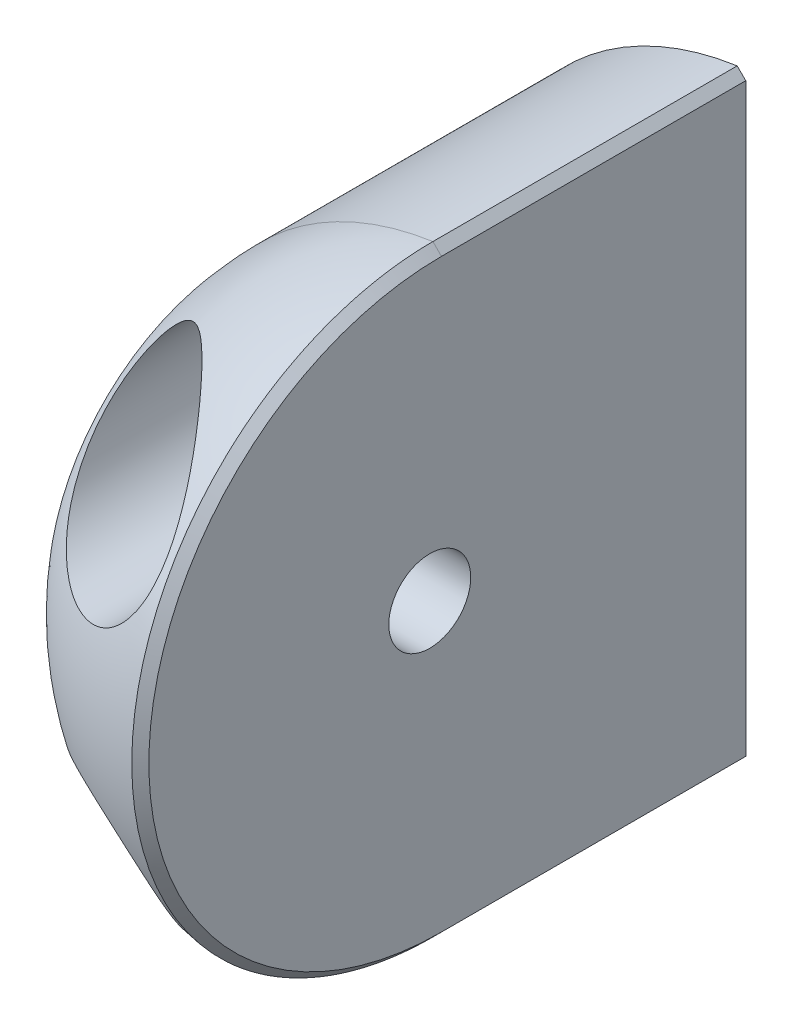
ISO-10303-21;
HEADER;
FILE_DESCRIPTION(('STEP AP214'),'2;1');
FILE_NAME('part.step','',(''),(''),'','','');
FILE_SCHEMA(('AUTOMOTIVE_DESIGN { 1 0 10303 214 1 1 1 1 }'));
ENDSEC;
DATA;
#1=APPLICATION_CONTEXT('core data for automotive mechanical design processes');
#2=APPLICATION_PROTOCOL_DEFINITION('international standard','automotive_design',2000,#1);
#3=PRODUCT_CONTEXT('',#1,'mechanical');
#4=PRODUCT('Part','Part','',(#3));
#5=PRODUCT_RELATED_PRODUCT_CATEGORY('part','',(#4));
#6=PRODUCT_DEFINITION_FORMATION('','',#4);
#7=PRODUCT_DEFINITION_CONTEXT('part definition',#1,'design');
#8=PRODUCT_DEFINITION('design','',#6,#7);
#9=PRODUCT_DEFINITION_SHAPE('','',#8);
#10=(LENGTH_UNIT() NAMED_UNIT(*) SI_UNIT(.MILLI.,.METRE.));
#11=(NAMED_UNIT(*) PLANE_ANGLE_UNIT() SI_UNIT($,.RADIAN.));
#12=(NAMED_UNIT(*) SI_UNIT($,.STERADIAN.) SOLID_ANGLE_UNIT());
#13=UNCERTAINTY_MEASURE_WITH_UNIT(LENGTH_MEASURE(1.E-05),#10,'distance_accuracy_value','');
#14=(GEOMETRIC_REPRESENTATION_CONTEXT(3) GLOBAL_UNCERTAINTY_ASSIGNED_CONTEXT((#13)) GLOBAL_UNIT_ASSIGNED_CONTEXT((#10,
#11,#12)) REPRESENTATION_CONTEXT('',''));
#15=CARTESIAN_POINT('',(0.,0.,0.));
#16=DIRECTION('',(0.,0.,1.));
#17=DIRECTION('',(1.,0.,0.));
#18=AXIS2_PLACEMENT_3D('',#15,#16,#17);
#19=CARTESIAN_POINT('',(-23.5,55.5,-13.));
#20=DIRECTION('',(0.,0.,1.));
#21=DIRECTION('',(1.,0.,0.));
#22=AXIS2_PLACEMENT_3D('',#19,#20,#21);
#23=CYLINDRICAL_SURFACE('',#22,13.);
#24=CARTESIAN_POINT('',(-23.5,55.5,-13.));
#25=DIRECTION('',(0.,0.,-1.));
#26=DIRECTION('',(-1.,0.,0.));
#27=AXIS2_PLACEMENT_3D('',#24,#25,#26);
#28=CIRCLE('',#27,13.);
#29=CARTESIAN_POINT('',(-33.5,63.8066238629181,-13.));
#30=VERTEX_POINT('',#29);
#31=CARTESIAN_POINT('',(-25.3654599313282,68.3654599313281,-13.));
#32=VERTEX_POINT('',#31);
#33=EDGE_CURVE('E230',#30,#32,#28,.T.);
#34=ORIENTED_EDGE('',*,*,#33,.F.);
#35=DIRECTION('',(0.,0.,-1.));
#36=VECTOR('',#35,1.);
#37=CARTESIAN_POINT('',(-33.5,63.8066238629181,12.8654599313281));
#38=LINE('',#37,#36);
#39=CARTESIAN_POINT('',(-33.5,63.8066238629181,0.));
#40=VERTEX_POINT('',#39);
#41=EDGE_CURVE('E138',#40,#30,#38,.T.);
#42=ORIENTED_EDGE('',*,*,#41,.F.);
#43=CARTESIAN_POINT('',(-23.5,55.5,0.));
#44=DIRECTION('',(0.,0.,1.));
#45=DIRECTION('',(1.,0.,0.));
#46=AXIS2_PLACEMENT_3D('',#43,#44,#45);
#47=CIRCLE('',#46,13.);
#48=CARTESIAN_POINT('',(-25.3654599313281,68.3654599313281,0.));
#49=VERTEX_POINT('',#48);
#50=EDGE_CURVE('E188',#49,#40,#47,.T.);
#51=ORIENTED_EDGE('',*,*,#50,.F.);
#52=DIRECTION('',(0.,0.,1.));
#53=VECTOR('',#52,1.);
#54=CARTESIAN_POINT('',(-25.3654599313281,68.3654599313281,-13.));
#55=LINE('',#54,#53);
#56=EDGE_CURVE('E117',#49,#32,#55,.F.);
#57=ORIENTED_EDGE('',*,*,#56,.T.);
#58=EDGE_LOOP('',(#34,#42,#51,#57));
#59=FACE_BOUND('',#58,.T.);
#60=ADVANCED_FACE('F32',(#59),#23,.T.);
#61=CARTESIAN_POINT('',(-29.1999999999999,49.,13.));
#62=DIRECTION('',(0.,0.,-1.));
#63=DIRECTION('',(-1.,0.,0.));
#64=AXIS2_PLACEMENT_3D('',#61,#62,#63);
#65=CYLINDRICAL_SURFACE('',#64,2.5);
#66=CARTESIAN_POINT('',(-29.1999999999999,49.,-13.));
#67=DIRECTION('',(0.,0.,-1.));
#68=DIRECTION('',(-1.,0.,0.));
#69=AXIS2_PLACEMENT_3D('',#66,#67,#68);
#70=CIRCLE('',#69,2.5);
#71=CARTESIAN_POINT('',(-31.6999999999999,49.,-13.));
#72=VERTEX_POINT('',#71);
#73=EDGE_CURVE('E221',#72,#72,#70,.T.);
#74=ORIENTED_EDGE('',*,*,#73,.T.);
#75=EDGE_LOOP('',(#74));
#76=FACE_BOUND('',#75,.T.);
#77=CARTESIAN_POINT('',(-29.1999999999999,49.,-6.5));
#78=DIRECTION('',(0.,0.,1.));
#79=DIRECTION('',(1.,0.,0.));
#80=AXIS2_PLACEMENT_3D('',#77,#78,#79);
#81=CIRCLE('',#80,2.5);
#82=CARTESIAN_POINT('',(-26.6999999999999,49.,-6.5));
#83=VERTEX_POINT('',#82);
#84=EDGE_CURVE('E204',#83,#83,#81,.T.);
#85=ORIENTED_EDGE('',*,*,#84,.T.);
#86=EDGE_LOOP('',(#85));
#87=FACE_BOUND('',#86,.T.);
#88=ADVANCED_FACE('F270',(#76,#87),#65,.F.);
#89=CARTESIAN_POINT('',(-29.1999999999998,62.,13.));
#90=DIRECTION('',(0.,0.,-1.));
#91=DIRECTION('',(-1.,0.,0.));
#92=AXIS2_PLACEMENT_3D('',#89,#90,#91);
#93=CYLINDRICAL_SURFACE('',#92,2.5);
#94=CARTESIAN_POINT('',(-29.1999999999998,62.,-13.));
#95=DIRECTION('',(0.,0.,-1.));
#96=DIRECTION('',(-1.,0.,0.));
#97=AXIS2_PLACEMENT_3D('',#94,#95,#96);
#98=CIRCLE('',#97,2.5);
#99=CARTESIAN_POINT('',(-31.6999999999998,62.,-13.));
#100=VERTEX_POINT('',#99);
#101=EDGE_CURVE('E231',#100,#100,#98,.T.);
#102=ORIENTED_EDGE('',*,*,#101,.T.);
#103=EDGE_LOOP('',(#102));
#104=FACE_BOUND('',#103,.T.);
#105=CARTESIAN_POINT('',(-29.1999999999998,62.,-6.5));
#106=DIRECTION('',(0.,0.,1.));
#107=DIRECTION('',(1.,0.,0.));
#108=AXIS2_PLACEMENT_3D('',#105,#106,#107);
#109=CIRCLE('',#108,2.5);
#110=CARTESIAN_POINT('',(-26.6999999999998,62.,-6.5));
#111=VERTEX_POINT('',#110);
#112=EDGE_CURVE('E222',#111,#111,#109,.T.);
#113=ORIENTED_EDGE('',*,*,#112,.T.);
#114=EDGE_LOOP('',(#113));
#115=FACE_BOUND('',#114,.T.);
#116=ADVANCED_FACE('F211',(#104,#115),#93,.F.);
#117=CARTESIAN_POINT('',(-23.5,55.5,0.));
#118=DIRECTION('',(0.,-1.,0.));
#119=DIRECTION('',(0.,0.,1.));
#120=AXIS2_PLACEMENT_3D('',#117,#118,#119);
#121=SPHERICAL_SURFACE('',#120,13.);
#122=CARTESIAN_POINT('',(-30.7731713308915,45.8734792558403,4.84056578859972));
#123=CARTESIAN_POINT('',(-30.8619727950089,45.9181646135803,4.7960052292137));
#124=CARTESIAN_POINT('',(-30.951140970031,45.967771100755,4.75699494009806));
#125=CARTESIAN_POINT('',(-31.1284422234021,46.0773428698477,4.69384980519464));
#126=CARTESIAN_POINT('',(-31.2165764645147,46.1372950195693,4.66969627636443));
#127=CARTESIAN_POINT('',(-31.3897336302836,46.2674430844061,4.63940255595307));
#128=CARTESIAN_POINT('',(-31.474720364549,46.3377283735637,4.63343054697689));
#129=CARTESIAN_POINT('',(-31.6371503752147,46.4855666764086,4.64099765258224));
#130=CARTESIAN_POINT('',(-31.7145917184646,46.5631215426486,4.65454175328599));
#131=CARTESIAN_POINT('',(-31.8637567587637,46.7268094937979,4.70023561908632));
#132=CARTESIAN_POINT('',(-31.9348917690989,46.813179314776,4.73341494763122));
#133=CARTESIAN_POINT('',(-32.0656690142341,46.9875684760903,4.81470825559536));
#134=CARTESIAN_POINT('',(-32.1252869329177,47.0755908850642,4.86285328529589));
#135=CARTESIAN_POINT('',(-32.2658553828278,47.3036371124902,5.00136458460291));
#136=CARTESIAN_POINT('',(-32.3386136859353,47.4436742029609,5.09987451090306));
#137=CARTESIAN_POINT('',(-32.4618241954573,47.7218249127127,5.31228155613165));
#138=CARTESIAN_POINT('',(-32.5122103697854,47.85993168791,5.42622294680135));
#139=CARTESIAN_POINT('',(-32.589244018333,48.1174921560098,5.64897675372043));
#140=CARTESIAN_POINT('',(-32.6180051636216,48.2372070635038,5.75678170983932));
#141=CARTESIAN_POINT('',(-32.6625075498483,48.4749479105977,5.97694487104717));
#142=CARTESIAN_POINT('',(-32.6782396208657,48.592972603303,6.0893062247066));
#143=CARTESIAN_POINT('',(-32.6977116549664,48.8272828060769,6.31694024911347));
#144=CARTESIAN_POINT('',(-32.7014447599822,48.9435672837418,6.43221454685019));
#145=CARTESIAN_POINT('',(-32.697565416748,49.1741465548889,6.66446929960028));
#146=CARTESIAN_POINT('',(-32.6899555631501,49.2884417973503,6.78144935836771));
#147=CARTESIAN_POINT('',(-32.6630198849927,49.5216065962778,7.02338552694212));
#148=CARTESIAN_POINT('',(-32.6430187955437,49.6403394006928,7.14839923865985));
#149=CARTESIAN_POINT('',(-32.591028129609,49.8748512254301,7.39872028470763));
#150=CARTESIAN_POINT('',(-32.5590340092676,49.9906291084271,7.52402771241491));
#151=CARTESIAN_POINT('',(-32.4452298855063,50.3327567101925,7.89953255854781));
#152=CARTESIAN_POINT('',(-32.3455891584671,50.5539769403998,8.1493920967124));
#153=CARTESIAN_POINT('',(-32.1501192775465,50.8887599413491,8.54129690779853));
#154=CARTESIAN_POINT('',(-32.0696027693782,51.0091557383828,8.68538756323934));
#155=CARTESIAN_POINT('',(-31.892266367979,51.2412103277749,8.97074172281868));
#156=CARTESIAN_POINT('',(-31.7954419257805,51.3528666695684,9.11200442578721));
#157=CARTESIAN_POINT('',(-31.5857551755015,51.5652300648439,9.39040680083171));
#158=CARTESIAN_POINT('',(-31.4729169412152,51.6659531604353,9.5275522940828));
#159=CARTESIAN_POINT('',(-31.2314240749443,51.8542504976179,9.79668947473079));
#160=CARTESIAN_POINT('',(-31.1027799692453,51.9418334048097,9.92868451583073));
#161=CARTESIAN_POINT('',(-30.7939908398866,52.122351285729,10.2203493215423));
#162=CARTESIAN_POINT('',(-30.6092190430445,52.2105863485905,10.3781167675911));
#163=CARTESIAN_POINT('',(-30.2173089730363,52.3553836527353,10.6796699485498));
#164=CARTESIAN_POINT('',(-30.0102043537847,52.4119927777642,10.8234761173959));
#165=CARTESIAN_POINT('',(-29.6180118224716,52.4795345214665,11.0675492257298));
#166=CARTESIAN_POINT('',(-29.4360079556056,52.4970108467327,11.1709367742243));
#167=CARTESIAN_POINT('',(-29.0636108294,52.5022802803081,11.3623776977585));
#168=CARTESIAN_POINT('',(-28.8732258519588,52.4901020731181,11.4504458028238));
#169=CARTESIAN_POINT('',(-28.5191525253904,52.4370607095547,11.5955981958156));
#170=CARTESIAN_POINT('',(-28.3558660123791,52.4009017679717,11.6553651198937));
#171=CARTESIAN_POINT('',(-28.0316814424963,52.3035769434372,11.7591680707859));
#172=CARTESIAN_POINT('',(-27.8707824594256,52.2424210351491,11.8032103591612));
#173=CARTESIAN_POINT('',(-27.5558759647742,52.0947108436188,11.8737323692016));
#174=CARTESIAN_POINT('',(-27.4019061868323,52.0080332773524,11.9001247596204));
#175=CARTESIAN_POINT('',(-27.1074777043253,51.8111682419632,11.9335758924912));
#176=CARTESIAN_POINT('',(-26.9670140007342,51.7009895203364,11.9406418150656));
#177=CARTESIAN_POINT('',(-26.7163763055407,51.4714211922255,11.9353164329985));
#178=CARTESIAN_POINT('',(-26.6046223222058,51.3537070535954,11.9245900744791));
#179=CARTESIAN_POINT('',(-26.3995127842316,51.1055128390508,11.8872858865309));
#180=CARTESIAN_POINT('',(-26.3061558358896,50.9750337312925,11.8607092584843));
#181=CARTESIAN_POINT('',(-26.1394153474627,50.7052892911294,11.7928185032831));
#182=CARTESIAN_POINT('',(-26.0660563965128,50.5660133991042,11.7514863759255));
#183=CARTESIAN_POINT('',(-25.9398760520319,50.2828284991487,11.6556627364691));
#184=CARTESIAN_POINT('',(-25.8870598147843,50.1389183378049,11.6011679260537));
#185=CARTESIAN_POINT('',(-25.7971447503708,49.8354978122602,11.4746850260017));
#186=CARTESIAN_POINT('',(-25.7621536082963,49.6758704428133,11.4014906099005));
#187=CARTESIAN_POINT('',(-25.7147789091377,49.3590868991332,11.243482993892));
#188=CARTESIAN_POINT('',(-25.702410049171,49.2019323971299,11.1586622791078));
#189=CARTESIAN_POINT('',(-25.6973313157656,48.8262487134251,10.9406601477402));
#190=CARTESIAN_POINT('',(-25.7154038213249,48.6104888411348,10.8024012160466));
#191=CARTESIAN_POINT('',(-25.7871689847277,48.1955686510909,10.510947540325));
#192=CARTESIAN_POINT('',(-25.8409306206111,47.9964413205314,10.3577243642756));
#193=CARTESIAN_POINT('',(-25.9968317968406,47.5663316810109,9.99646344972966));
#194=CARTESIAN_POINT('',(-26.1082068299647,47.3416370875196,9.78493497416006));
#195=CARTESIAN_POINT('',(-26.368027581708,46.9288855564158,9.34973106056768));
#196=CARTESIAN_POINT('',(-26.5164906522024,46.7408458415409,9.1260499753081));
#197=CARTESIAN_POINT('',(-26.8444134557199,46.4003965056931,8.66731115729006));
#198=CARTESIAN_POINT('',(-27.0243226454668,46.2485916869892,8.43213004497077));
#199=CARTESIAN_POINT('',(-27.4067795486744,45.9853134211941,7.95726904985924));
#200=CARTESIAN_POINT('',(-27.6093470659088,45.8738756218161,7.71758538639488));
#201=CARTESIAN_POINT('',(-27.946589658659,45.7292573743275,7.33483347816924));
#202=CARTESIAN_POINT('',(-28.0757062361781,45.6826401876914,7.19177662408995));
#203=CARTESIAN_POINT('',(-28.3395401901459,45.6046291266595,6.90649928555428));
#204=CARTESIAN_POINT('',(-28.4742598322595,45.5732414767792,6.76427916650302));
#205=CARTESIAN_POINT('',(-28.7487744120972,45.5264142118883,6.48207380851203));
#206=CARTESIAN_POINT('',(-28.8885702864824,45.510977555777,6.34208898895882));
#207=CARTESIAN_POINT('',(-29.1730035456136,45.4972081086282,6.0663333126501));
#208=CARTESIAN_POINT('',(-29.3176368107602,45.4988611157236,5.93055905094252));
#209=CARTESIAN_POINT('',(-29.5431668519085,45.5159797346806,5.72805553279235));
#210=CARTESIAN_POINT('',(-29.6222637746574,45.5246296533504,5.65871083990498));
#211=CARTESIAN_POINT('',(-29.7819612209265,45.5477782572214,5.52280407486055));
#212=CARTESIAN_POINT('',(-29.8625612329522,45.5622749862082,5.45624108022077));
#213=CARTESIAN_POINT('',(-30.0249506469735,45.5976001176304,5.32714808877782));
#214=CARTESIAN_POINT('',(-30.1067321246341,45.6183966214597,5.26459965461076));
#215=CARTESIAN_POINT('',(-30.2718343376384,45.6670464491189,5.14454077630667));
#216=CARTESIAN_POINT('',(-30.3551543640207,45.6948965943333,5.08702807856025));
#217=CARTESIAN_POINT('',(-30.5494711766201,45.7684659982163,4.96196339783756));
#218=CARTESIAN_POINT('',(-30.6610288425895,45.8170485735602,4.89683886989785));
#219=CARTESIAN_POINT('',(-30.7731713308915,45.8734792558403,4.84056578859972));
#220=B_SPLINE_CURVE_WITH_KNOTS('',3,(#122,#123,#124,#125,#126,#127,#128,#129,#130,#131,#132,
#133,#134,#135,#136,#137,#138,#139,#140,#141,#142,#143,#144,#145,#146,#147,#148,#149,#150,#151,
#152,#153,#154,#155,#156,#157,#158,#159,#160,#161,#162,#163,#164,#165,#166,#167,#168,#169,#170,
#171,#172,#173,#174,#175,#176,#177,#178,#179,#180,#181,#182,#183,#184,#185,#186,#187,#188,#189,
#190,#191,#192,#193,#194,#195,#196,#197,#198,#199,#200,#201,#202,#203,#204,#205,#206,#207,#208,
#209,#210,#211,#212,#213,#214,#215,#216,#217,#218,#219),.UNSPECIFIED.,.T.,.F.,(4,2,2,2,2,2,2,2,
2,2,2,2,2,2,2,2,2,2,2,2,2,2,2,2,2,2,2,2,2,2,2,2,2,2,2,2,2,2,2,2,2,2,2,2,2,2,2,2,4),(0.,
0.326516817541047,0.65262218154321,0.981735056429128,1.31093203045322,1.65914508961175,
2.00808548554219,2.56308193164554,3.11970575269486,3.60998300326751,4.10060502062323,
4.59150740557064,5.08229751597845,5.60252149935342,6.12294278196345,7.16345582478041,
7.77568173544741,8.38807870531564,8.99956461354836,9.61064547377463,10.3831813071832,
11.1545688381974,11.782279959157,12.4093841433355,12.9399546092666,13.4703135654064,
14.0032776823945,14.5360437669398,15.0217091070194,15.5073376404347,15.9935606268825,
16.4799055781387,17.0150289458206,17.5504998461299,18.3169653658917,19.0849165990154,
20.0639439331979,21.0434301722335,22.038272172744,23.033990578821,23.6282219660163,
24.222696019383,24.8172803275244,25.4113705634296,25.7278386797959,26.0442010005995,
26.3589874780997,26.6736323535044,27.0859724962642),.UNSPECIFIED.);
#221=CARTESIAN_POINT('',(-30.7731713308915,45.8734792558403,4.84056578859972));
#222=VERTEX_POINT('',#221);
#223=EDGE_CURVE('E197',#222,#222,#220,.T.);
#224=ORIENTED_EDGE('',*,*,#223,.T.);
#225=EDGE_LOOP('',(#224));
#226=FACE_BOUND('',#225,.T.);
#227=CARTESIAN_POINT('',(-32.6928072018036,62.2242718239711,6.26709375929672));
#228=CARTESIAN_POINT('',(-32.6859911263324,62.3304306461002,6.16318910613144));
#229=CARTESIAN_POINT('',(-32.6742773837024,62.4373411130493,6.06036733012357));
#230=CARTESIAN_POINT('',(-32.6403298496844,62.652707887824,5.85792453817322));
#231=CARTESIAN_POINT('',(-32.6180884956682,62.7611652524726,5.75830587825242));
#232=CARTESIAN_POINT('',(-32.5621174186281,62.9791817973295,5.56433877786192));
#233=CARTESIAN_POINT('',(-32.5284275931308,63.08873588569,5.46997334166268));
#234=CARTESIAN_POINT('',(-32.4480491829262,63.3091701218667,5.28877999783641));
#235=CARTESIAN_POINT('',(-32.4013811201123,63.420047913804,5.20194047187255));
#236=CARTESIAN_POINT('',(-32.304216795494,63.6197068435638,5.05666664373923));
#237=CARTESIAN_POINT('',(-32.2565458001152,63.7082767664269,4.99608439960857));
#238=CARTESIAN_POINT('',(-32.1504627200332,63.8855858702534,4.885199790791));
#239=CARTESIAN_POINT('',(-32.092052573812,63.9743250178144,4.83489557431198));
#240=CARTESIAN_POINT('',(-31.9625820929905,64.1518243192317,4.74813357341066));
#241=CARTESIAN_POINT('',(-31.8913563712829,64.2405674339955,4.71187912876));
#242=CARTESIAN_POINT('',(-31.737244034895,64.4136498262124,4.65926070129644));
#243=CARTESIAN_POINT('',(-31.6543888376576,64.4980001558291,4.6428442373497));
#244=CARTESIAN_POINT('',(-31.4900898624298,64.6488545538007,4.63334390033171));
#245=CARTESIAN_POINT('',(-31.4096436221108,64.7162887802697,4.6377242344742));
#246=CARTESIAN_POINT('',(-31.2447348816441,64.8425117746501,4.66342384819831));
#247=CARTESIAN_POINT('',(-31.1602675729016,64.9012898290033,4.68476391306436));
#248=CARTESIAN_POINT('',(-30.9717032480745,65.020946094156,4.74778395936651));
#249=CARTESIAN_POINT('',(-30.8673167247024,65.079522342542,4.79286802985258));
#250=CARTESIAN_POINT('',(-30.659507683218,65.1833020562611,4.89810555720448));
#251=CARTESIAN_POINT('',(-30.5560879352348,65.2284744475975,4.9582934424929));
#252=CARTESIAN_POINT('',(-30.3678979356648,65.3006762924565,5.07840454573323));
#253=CARTESIAN_POINT('',(-30.2828018190063,65.3294548482217,5.13681552085874));
#254=CARTESIAN_POINT('',(-30.1142067128721,65.3796402424588,5.25894001367314));
#255=CARTESIAN_POINT('',(-30.0307088657149,65.4010419816676,5.32265716165637));
#256=CARTESIAN_POINT('',(-29.8651961033537,65.4372522753523,5.45406386324116));
#257=CARTESIAN_POINT('',(-29.7831843513002,65.45204806199,5.52176082574172));
#258=CARTESIAN_POINT('',(-29.6207160943439,65.4755910666163,5.66003028788985));
#259=CARTESIAN_POINT('',(-29.5402601122373,65.484336284581,5.73060373020689));
#260=CARTESIAN_POINT('',(-29.326039968562,65.500332760178,5.92312334805262));
#261=CARTESIAN_POINT('',(-29.1936442657372,65.5024258419451,6.04703941774622));
#262=CARTESIAN_POINT('',(-28.9329119457659,65.4922312962489,6.29854411795461));
#263=CARTESIAN_POINT('',(-28.8045778756666,65.4799348216977,6.4261349607548));
#264=CARTESIAN_POINT('',(-28.5520330875806,65.4418669173877,6.68349603424949));
#265=CARTESIAN_POINT('',(-28.4278246871751,65.4160880456668,6.81326743022949));
#266=CARTESIAN_POINT('',(-28.1839464636907,65.3516469953035,7.07379513505867));
#267=CARTESIAN_POINT('',(-28.064275693692,65.3129875212693,7.20455123151632));
#268=CARTESIAN_POINT('',(-27.8256194853099,65.221489846786,7.47107483130704));
#269=CARTESIAN_POINT('',(-27.7068210974239,65.16818250127,7.60684979226669));
#270=CARTESIAN_POINT('',(-27.4753963046875,65.0483981630782,7.87779892747469));
#271=CARTESIAN_POINT('',(-27.3627705888357,64.9819197040387,8.01297303311396));
#272=CARTESIAN_POINT('',(-27.0357010995391,64.7630677517368,8.41635613043842));
#273=CARTESIAN_POINT('',(-26.8316593722938,64.5911232898298,8.68287701785993));
#274=CARTESIAN_POINT('',(-26.4885442070189,64.2252195480377,9.16749471059408));
#275=CARTESIAN_POINT('',(-26.3443495530753,64.0379595018998,9.38705234919822));
#276=CARTESIAN_POINT('',(-26.0924401509716,63.628117861692,9.81407219351423));
#277=CARTESIAN_POINT('',(-25.9846881986328,63.4055726331985,10.0215465547118));
#278=CARTESIAN_POINT('',(-25.8345431933781,62.9811692712333,10.3752193815855));
#279=CARTESIAN_POINT('',(-25.7830062075867,62.7854466593961,10.5248894788211));
#280=CARTESIAN_POINT('',(-25.7143699679927,62.3780758176466,10.8097827473915));
#281=CARTESIAN_POINT('',(-25.6972253337783,62.1664489565229,10.9450247329644));
#282=CARTESIAN_POINT('',(-25.7029009597076,61.7741843636872,11.1724167890035));
#283=CARTESIAN_POINT('',(-25.718682674265,61.5953940753516,11.2678556592943));
#284=CARTESIAN_POINT('',(-25.7644139808778,61.3253816289246,11.3994585069656));
#285=CARTESIAN_POINT('',(-25.7833484579223,61.2350295967175,11.4414174055942));
#286=CARTESIAN_POINT('',(-25.8288729660853,61.0543968115337,11.5210795170537));
#287=CARTESIAN_POINT('',(-25.855459519863,60.9641160448163,11.5587846521173));
#288=CARTESIAN_POINT('',(-25.916793095178,60.7835595155678,11.6298564452146));
#289=CARTESIAN_POINT('',(-25.951612807153,60.6932914110221,11.6631800868181));
#290=CARTESIAN_POINT('',(-26.0293665104779,60.514545720331,11.7246352482446));
#291=CARTESIAN_POINT('',(-26.0722961269606,60.4260671971585,11.7527695513451));
#292=CARTESIAN_POINT('',(-26.1662130901779,60.2518805251146,11.8034472304173));
#293=CARTESIAN_POINT('',(-26.2171960532395,60.1661708994474,11.8259936309946));
#294=CARTESIAN_POINT('',(-26.3270101815971,59.9985091162575,11.8651527625872));
#295=CARTESIAN_POINT('',(-26.3858398266924,59.9165562350326,11.8817666406708));
#296=CARTESIAN_POINT('',(-26.5017998300862,59.7690377142429,11.9068099741929));
#297=CARTESIAN_POINT('',(-26.557928466855,59.7028244045316,11.9160793083574));
#298=CARTESIAN_POINT('',(-26.6752202826253,59.5745017600968,11.9299628839458));
#299=CARTESIAN_POINT('',(-26.7363828860979,59.5123919576827,11.9345776567239));
#300=CARTESIAN_POINT('',(-26.8632480828979,59.3928600435299,11.9390869525187));
#301=CARTESIAN_POINT('',(-26.9289487027501,59.3354359175077,11.9389835146285));
#302=CARTESIAN_POINT('',(-27.0643249021,59.2257441298392,11.9340699260346));
#303=CARTESIAN_POINT('',(-27.1340003529078,59.1734763014009,11.9292599276302));
#304=CARTESIAN_POINT('',(-27.3365139846618,59.0330486419828,11.9090009448792));
#305=CARTESIAN_POINT('',(-27.4734474002469,58.9514253418487,11.8880188286804));
#306=CARTESIAN_POINT('',(-27.7545109646994,58.8085304379022,11.8312496904199));
#307=CARTESIAN_POINT('',(-27.8986413779118,58.7472595822661,11.7954621242038));
#308=CARTESIAN_POINT('',(-28.195393970846,58.6434623107895,11.708946539695));
#309=CARTESIAN_POINT('',(-28.3481350584141,58.6016901353646,11.657727027898));
#310=CARTESIAN_POINT('',(-28.6531556284545,58.5394752489542,11.5427098725918));
#311=CARTESIAN_POINT('',(-28.8054349351722,58.5190398383032,11.4789079328992));
#312=CARTESIAN_POINT('',(-29.125394343614,58.4966750188352,11.3318039842179));
#313=CARTESIAN_POINT('',(-29.2925914408932,58.49740788388,11.2470570102589));
#314=CARTESIAN_POINT('',(-29.6190706499115,58.521317018702,11.0663303816414));
#315=CARTESIAN_POINT('',(-29.7783469117402,58.5445096246591,10.9703425956099));
#316=CARTESIAN_POINT('',(-30.1580109670798,58.6257841926852,10.722639982938));
#317=CARTESIAN_POINT('',(-30.3726216620641,58.6950369129183,10.5656726686651));
#318=CARTESIAN_POINT('',(-30.7757457917855,58.8670692592212,10.237270922305));
#319=CARTESIAN_POINT('',(-30.9642114325335,58.9699091623887,10.0658108940461));
#320=CARTESIAN_POINT('',(-31.3597706615279,59.2330648521094,9.66482681837409));
#321=CARTESIAN_POINT('',(-31.5582609398429,59.401399438895,9.43208093956335));
#322=CARTESIAN_POINT('',(-31.9082829845196,59.7684729159792,8.95558116983264));
#323=CARTESIAN_POINT('',(-32.0597518260458,59.9672520212431,8.71181302394889));
#324=CARTESIAN_POINT('',(-32.3173666800682,60.3893885960723,8.21417443472337));
#325=CARTESIAN_POINT('',(-32.4227875088364,60.613074206387,7.96020668773616));
#326=CARTESIAN_POINT('',(-32.5439707649133,60.9594321770163,7.57841583103647));
#327=CARTESIAN_POINT('',(-32.578193761575,61.0765857129339,7.45112076993641));
#328=CARTESIAN_POINT('',(-32.6342832094409,61.3140176534489,7.19674042437639));
#329=CARTESIAN_POINT('',(-32.656153796824,61.434294997918,7.06965508392114));
#330=CARTESIAN_POINT('',(-32.6856922620591,61.6651908817717,6.8292454945438));
#331=CARTESIAN_POINT('',(-32.6945708510502,61.7755589988695,6.71582696947624));
#332=CARTESIAN_POINT('',(-32.7017792456214,61.9984202066795,6.49022310111458));
#333=CARTESIAN_POINT('',(-32.7000852732657,62.1109175195709,6.37804110636851));
#334=CARTESIAN_POINT('',(-32.6928072018036,62.2242718239711,6.26709375929672));
#335=B_SPLINE_CURVE_WITH_KNOTS('',3,(#227,#228,#229,#230,#231,#232,#233,#234,#235,#236,#237,
#238,#239,#240,#241,#242,#243,#244,#245,#246,#247,#248,#249,#250,#251,#252,#253,#254,#255,#256,
#257,#258,#259,#260,#261,#262,#263,#264,#265,#266,#267,#268,#269,#270,#271,#272,#273,#274,#275,
#276,#277,#278,#279,#280,#281,#282,#283,#284,#285,#286,#287,#288,#289,#290,#291,#292,#293,#294,
#295,#296,#297,#298,#299,#300,#301,#302,#303,#304,#305,#306,#307,#308,#309,#310,#311,#312,#313,
#314,#315,#316,#317,#318,#319,#320,#321,#322,#323,#324,#325,#326,#327,#328,#329,#330,#331,#332,
#333,#334),.UNSPECIFIED.,.T.,.F.,(4,2,2,2,2,2,2,2,2,2,2,2,2,2,2,2,2,2,2,2,2,2,2,2,2,2,2,2,2,2,2,
2,2,2,2,2,2,2,2,2,2,2,2,2,2,2,2,2,2,2,2,2,2,4),(0.,0.446012284243509,0.892345453817051,
1.33713885347379,1.78123288210759,2.13276532264696,2.48423437163236,2.84061546416493,
3.19605167628705,3.50934301211339,3.82301890063615,4.20462692889237,4.58711284378993,
4.90812418314532,5.22935698033222,5.5512079894848,5.87316533617258,6.41641110384445,
6.95999104924672,7.50387135499324,8.04763753120998,8.61140097239098,9.17522721367374,
10.3010213287119,11.2652737058894,12.2285386898517,12.9809427059205,13.7323532766177,
14.3395536644034,14.643442884613,14.9471942255909,15.2537347108258,15.560110303356,
15.8663196977197,16.1724698536212,16.4340051492341,16.6955105851821,16.9569030060703,
17.2182869688661,17.6982511933364,18.1782330598179,18.6754949690039,19.1729269597323,
19.7331633091751,20.2938074550023,21.1135607880116,21.9347934471595,22.9767060122351,
24.0200069299207,25.079192795305,25.6078887451468,26.1364075571208,26.6115816486697,
27.0878248022802),.UNSPECIFIED.);
#336=CARTESIAN_POINT('',(-32.6928072018036,62.2242718239711,6.26709375929672));
#337=VERTEX_POINT('',#336);
#338=EDGE_CURVE('E216',#337,#337,#335,.T.);
#339=ORIENTED_EDGE('',*,*,#338,.T.);
#340=EDGE_LOOP('',(#339));
#341=FACE_BOUND('',#340,.T.);
#342=ORIENTED_EDGE('',*,*,#50,.T.);
#343=CARTESIAN_POINT('',(-33.5,55.5,0.));
#344=DIRECTION('',(1.,0.,0.));
#345=DIRECTION('',(0.,0.,-1.));
#346=AXIS2_PLACEMENT_3D('',#343,#344,#345);
#347=CIRCLE('',#346,8.30662386291807);
#348=CARTESIAN_POINT('',(-33.5,47.1933761370819,0.));
#349=VERTEX_POINT('',#348);
#350=EDGE_CURVE('E129',#40,#349,#347,.T.);
#351=ORIENTED_EDGE('',*,*,#350,.T.);
#352=CARTESIAN_POINT('',(-25.3654599313282,42.6345400686719,0.));
#353=VERTEX_POINT('',#352);
#354=EDGE_CURVE('E227',#349,#353,#47,.T.);
#355=ORIENTED_EDGE('',*,*,#354,.T.);
#356=CARTESIAN_POINT('',(-25.3654599313281,55.5,0.));
#357=DIRECTION('',(1.,0.,0.));
#358=DIRECTION('',(0.,0.,-1.));
#359=AXIS2_PLACEMENT_3D('',#356,#357,#358);
#360=CIRCLE('',#359,12.8654599313281);
#361=EDGE_CURVE('E40',#353,#49,#360,.F.);
#362=ORIENTED_EDGE('',*,*,#361,.T.);
#363=EDGE_LOOP('',(#342,#351,#355,#362));
#364=FACE_BOUND('',#363,.T.);
#365=ADVANCED_FACE('F206',(#226,#341,#364),#121,.T.);
#366=CARTESIAN_POINT('',(-23.5,55.5,-13.));
#367=DIRECTION('',(0.,0.,-1.));
#368=DIRECTION('',(-1.,0.,0.));
#369=AXIS2_PLACEMENT_3D('',#366,#367,#368);
#370=PLANE('',#369);
#371=DIRECTION('',(0.,1.,0.));
#372=VECTOR('',#371,1.);
#373=CARTESIAN_POINT('',(-25.,68.,-13.));
#374=LINE('',#373,#372);
#375=CARTESIAN_POINT('',(-25.,43.,-13.));
#376=VERTEX_POINT('',#375);
#377=CARTESIAN_POINT('',(-25.,68.,-13.));
#378=VERTEX_POINT('',#377);
#379=EDGE_CURVE('E46',#376,#378,#374,.T.);
#380=ORIENTED_EDGE('',*,*,#379,.F.);
#381=DIRECTION('',(0.707106781186548,0.707106781186548,0.));
#382=VECTOR('',#381,1.);
#383=CARTESIAN_POINT('',(-18.,50.,-13.));
#384=LINE('',#383,#382);
#385=CARTESIAN_POINT('',(-25.3654599313282,42.6345400686719,-13.));
#386=VERTEX_POINT('',#385);
#387=EDGE_CURVE('E109',#376,#386,#384,.F.);
#388=ORIENTED_EDGE('',*,*,#387,.T.);
#389=CARTESIAN_POINT('',(-33.5,47.1933761370819,-13.));
#390=VERTEX_POINT('',#389);
#391=EDGE_CURVE('E228',#386,#390,#28,.T.);
#392=ORIENTED_EDGE('',*,*,#391,.T.);
#393=DIRECTION('',(0.,-1.,0.));
#394=VECTOR('',#393,1.);
#395=CARTESIAN_POINT('',(-33.5,47.1933761370819,-13.));
#396=LINE('',#395,#394);
#397=EDGE_CURVE('E54',#30,#390,#396,.T.);
#398=ORIENTED_EDGE('',*,*,#397,.F.);
#399=ORIENTED_EDGE('',*,*,#33,.T.);
#400=DIRECTION('',(-0.707106781186548,0.707106781186548,0.));
#401=VECTOR('',#400,1.);
#402=CARTESIAN_POINT('',(-18.,61.,-13.));
#403=LINE('',#402,#401);
#404=EDGE_CURVE('E112',#32,#378,#403,.F.);
#405=ORIENTED_EDGE('',*,*,#404,.T.);
#406=EDGE_LOOP('',(#380,#388,#392,#398,#399,#405));
#407=FACE_BOUND('',#406,.T.);
#408=ORIENTED_EDGE('',*,*,#101,.F.);
#409=EDGE_LOOP('',(#408));
#410=FACE_BOUND('',#409,.T.);
#411=ORIENTED_EDGE('',*,*,#73,.F.);
#412=EDGE_LOOP('',(#411));
#413=FACE_BOUND('',#412,.T.);
#414=ADVANCED_FACE('F106',(#407,#410,#413),#370,.T.);
#415=ORIENTED_EDGE('',*,*,#354,.F.);
#416=DIRECTION('',(0.,0.,-1.));
#417=VECTOR('',#416,1.);
#418=CARTESIAN_POINT('',(-33.5,47.1933761370819,12.8654599313281));
#419=LINE('',#418,#417);
#420=EDGE_CURVE('E133',#349,#390,#419,.T.);
#421=ORIENTED_EDGE('',*,*,#420,.T.);
#422=ORIENTED_EDGE('',*,*,#391,.F.);
#423=DIRECTION('',(0.,0.,1.));
#424=VECTOR('',#423,1.);
#425=CARTESIAN_POINT('',(-25.3654599313282,42.6345400686719,-13.));
#426=LINE('',#425,#424);
#427=EDGE_CURVE('E116',#386,#353,#426,.T.);
#428=ORIENTED_EDGE('',*,*,#427,.T.);
#429=EDGE_LOOP('',(#415,#421,#422,#428));
#430=FACE_BOUND('',#429,.T.);
#431=ADVANCED_FACE('F241',(#430),#23,.T.);
#432=CARTESIAN_POINT('',(-29.1999999999998,62.,-6.5));
#433=DIRECTION('',(0.,0.,1.));
#434=DIRECTION('',(1.,0.,0.));
#435=AXIS2_PLACEMENT_3D('',#432,#433,#434);
#436=CYLINDRICAL_SURFACE('',#435,3.5);
#437=DIRECTION('',(0.,0.,1.));
#438=VECTOR('',#437,1.);
#439=CARTESIAN_POINT('',(-30.,58.5926549925199,-6.5));
#440=LINE('',#439,#438);
#441=CARTESIAN_POINT('',(-30.,58.5926549925199,0.286727645387747));
#442=VERTEX_POINT('',#441);
#443=CARTESIAN_POINT('',(-30.,58.5926549925199,0.713272354612308));
#444=VERTEX_POINT('',#443);
#445=EDGE_CURVE('E152',#442,#444,#440,.T.);
#446=ORIENTED_EDGE('',*,*,#445,.T.);
#447=CARTESIAN_POINT('',(-30.,58.5926549925199,0.7132723546123));
#448=CARTESIAN_POINT('',(-30.0118571916938,58.595461748973,0.673060778071036));
#449=CARTESIAN_POINT('',(-30.020302041016,58.5974876855308,0.631782024490772));
#450=CARTESIAN_POINT('',(-30.0301524795817,58.5998659234944,0.549358549177826));
#451=CARTESIAN_POINT('',(-30.0317230436186,58.6002574383037,0.508234637768664));
#452=CARTESIAN_POINT('',(-30.0286472478199,58.5995090652522,0.436977005460587));
#453=CARTESIAN_POINT('',(-30.0255112586582,58.5987409102545,0.406766082085904));
#454=CARTESIAN_POINT('',(-30.0155669938193,58.5963445452732,0.346420676840519));
#455=CARTESIAN_POINT('',(-30.0086926667489,58.594700877206,0.316297677569183));
#456=CARTESIAN_POINT('',(-30.,58.5926549925199,0.286727645387754));
#457=B_SPLINE_CURVE_WITH_KNOTS('',3,(#447,#448,#449,#450,#451,#452,#453,#454,#455,#456),
.UNSPECIFIED.,.F.,.F.,(4,2,2,2,4),(0.,0.125918540283596,0.248798010751785,0.339725619688286,
0.432314616342389),.UNSPECIFIED.);
#458=EDGE_CURVE('E156',#444,#442,#457,.T.);
#459=ORIENTED_EDGE('',*,*,#458,.T.);
#460=EDGE_LOOP('',(#446,#459));
#461=FACE_BOUND('',#460,.T.);
#462=CARTESIAN_POINT('',(-29.1999999999998,62.,-6.5));
#463=DIRECTION('',(0.,0.,1.));
#464=DIRECTION('',(1.,0.,0.));
#465=AXIS2_PLACEMENT_3D('',#462,#463,#464);
#466=CIRCLE('',#465,3.5);
#467=CARTESIAN_POINT('',(-25.6999999999998,62.,-6.5));
#468=VERTEX_POINT('',#467);
#469=EDGE_CURVE('E203',#468,#468,#466,.T.);
#470=ORIENTED_EDGE('',*,*,#469,.F.);
#471=EDGE_LOOP('',(#470));
#472=FACE_BOUND('',#471,.T.);
#473=ORIENTED_EDGE('',*,*,#338,.F.);
#474=EDGE_LOOP('',(#473));
#475=FACE_BOUND('',#474,.T.);
#476=ADVANCED_FACE('F166',(#461,#472,#475),#436,.F.);
#477=CARTESIAN_POINT('',(-29.1999999999998,62.,-6.5));
#478=DIRECTION('',(0.,0.,1.));
#479=DIRECTION('',(1.,0.,0.));
#480=AXIS2_PLACEMENT_3D('',#477,#478,#479);
#481=PLANE('',#480);
#482=ORIENTED_EDGE('',*,*,#112,.F.);
#483=EDGE_LOOP('',(#482));
#484=FACE_BOUND('',#483,.T.);
#485=ORIENTED_EDGE('',*,*,#469,.T.);
#486=EDGE_LOOP('',(#485));
#487=FACE_BOUND('',#486,.T.);
#488=ADVANCED_FACE('F194',(#484,#487),#481,.T.);
#489=CARTESIAN_POINT('',(-29.1999999999999,49.,-6.5));
#490=DIRECTION('',(0.,0.,1.));
#491=DIRECTION('',(1.,0.,0.));
#492=AXIS2_PLACEMENT_3D('',#489,#490,#491);
#493=CYLINDRICAL_SURFACE('',#492,3.5);
#494=DIRECTION('',(0.,0.,1.));
#495=VECTOR('',#494,1.);
#496=CARTESIAN_POINT('',(-30.,52.4073450074801,-6.5));
#497=LINE('',#496,#495);
#498=CARTESIAN_POINT('',(-30.,52.4073450074801,0.713272354612407));
#499=VERTEX_POINT('',#498);
#500=CARTESIAN_POINT('',(-30.,52.4073450074801,0.286727645387647));
#501=VERTEX_POINT('',#500);
#502=EDGE_CURVE('E149',#499,#501,#497,.F.);
#503=ORIENTED_EDGE('',*,*,#502,.T.);
#504=CARTESIAN_POINT('',(-30.,52.4073450074801,0.286727645387655));
#505=CARTESIAN_POINT('',(-30.0118571916939,52.404538251027,0.326939221928916));
#506=CARTESIAN_POINT('',(-30.020302041016,52.4025123144692,0.368217975509178));
#507=CARTESIAN_POINT('',(-30.0301524795817,52.4001340765056,0.450641450822122));
#508=CARTESIAN_POINT('',(-30.0317230436186,52.3997425616963,0.491765362231284));
#509=CARTESIAN_POINT('',(-30.02864724782,52.4004909347477,0.563022994539394));
#510=CARTESIAN_POINT('',(-30.0255112586582,52.4012590897455,0.593233917914112));
#511=CARTESIAN_POINT('',(-30.0155669938193,52.4036554547268,0.653579323159567));
#512=CARTESIAN_POINT('',(-30.0086926667489,52.405299122794,0.683702322430938));
#513=CARTESIAN_POINT('',(-30.,52.4073450074801,0.7132723546124));
#514=B_SPLINE_CURVE_WITH_KNOTS('',3,(#504,#505,#506,#507,#508,#509,#510,#511,#512,#513),
.UNSPECIFIED.,.F.,.F.,(4,2,2,2,4),(0.,0.125918540283597,0.248798010751785,0.339725619688389,
0.432314616342601),.UNSPECIFIED.);
#515=EDGE_CURVE('E181',#501,#499,#514,.T.);
#516=ORIENTED_EDGE('',*,*,#515,.T.);
#517=EDGE_LOOP('',(#503,#516));
#518=FACE_BOUND('',#517,.T.);
#519=CARTESIAN_POINT('',(-29.1999999999999,49.,-6.5));
#520=DIRECTION('',(0.,0.,1.));
#521=DIRECTION('',(1.,0.,0.));
#522=AXIS2_PLACEMENT_3D('',#519,#520,#521);
#523=CIRCLE('',#522,3.5);
#524=CARTESIAN_POINT('',(-25.6999999999999,49.,-6.5));
#525=VERTEX_POINT('',#524);
#526=EDGE_CURVE('E164',#525,#525,#523,.T.);
#527=ORIENTED_EDGE('',*,*,#526,.F.);
#528=EDGE_LOOP('',(#527));
#529=FACE_BOUND('',#528,.T.);
#530=ORIENTED_EDGE('',*,*,#223,.F.);
#531=EDGE_LOOP('',(#530));
#532=FACE_BOUND('',#531,.T.);
#533=ADVANCED_FACE('F190',(#518,#529,#532),#493,.F.);
#534=CARTESIAN_POINT('',(-29.1999999999999,49.,-6.5));
#535=DIRECTION('',(0.,0.,1.));
#536=DIRECTION('',(1.,0.,0.));
#537=AXIS2_PLACEMENT_3D('',#534,#535,#536);
#538=PLANE('',#537);
#539=ORIENTED_EDGE('',*,*,#84,.F.);
#540=EDGE_LOOP('',(#539));
#541=FACE_BOUND('',#540,.T.);
#542=ORIENTED_EDGE('',*,*,#526,.T.);
#543=EDGE_LOOP('',(#542));
#544=FACE_BOUND('',#543,.T.);
#545=ADVANCED_FACE('F193',(#541,#544),#538,.T.);
#546=CARTESIAN_POINT('',(-36.5,55.5,0.50000000000005));
#547=DIRECTION('',(1.,0.,0.));
#548=DIRECTION('',(0.,0.,-1.));
#549=AXIS2_PLACEMENT_3D('',#546,#547,#548);
#550=CYLINDRICAL_SURFACE('',#549,1.75);
#551=CARTESIAN_POINT('',(-25.,55.5,0.50000000000001));
#552=DIRECTION('',(-1.,0.,0.));
#553=DIRECTION('',(0.,0.,1.));
#554=AXIS2_PLACEMENT_3D('',#551,#552,#553);
#555=CIRCLE('',#554,1.75);
#556=CARTESIAN_POINT('',(-25.,55.5,2.25000000000001));
#557=VERTEX_POINT('',#556);
#558=EDGE_CURVE('E256',#557,#557,#555,.F.);
#559=ORIENTED_EDGE('',*,*,#558,.T.);
#560=EDGE_LOOP('',(#559));
#561=FACE_BOUND('',#560,.T.);
#562=CARTESIAN_POINT('',(-30.,55.5,0.500000000000027));
#563=DIRECTION('',(1.,0.,0.));
#564=DIRECTION('',(0.,0.,-1.));
#565=AXIS2_PLACEMENT_3D('',#562,#563,#564);
#566=CIRCLE('',#565,1.75);
#567=CARTESIAN_POINT('',(-30.,55.5,-1.24999999999997));
#568=VERTEX_POINT('',#567);
#569=EDGE_CURVE('E153',#568,#568,#566,.F.);
#570=ORIENTED_EDGE('',*,*,#569,.T.);
#571=EDGE_LOOP('',(#570));
#572=FACE_BOUND('',#571,.T.);
#573=ADVANCED_FACE('F176',(#561,#572),#550,.F.);
#574=CARTESIAN_POINT('',(-43.,55.5,0.500000000000072));
#575=DIRECTION('',(1.,0.,0.));
#576=DIRECTION('',(0.,0.,-1.));
#577=AXIS2_PLACEMENT_3D('',#574,#575,#576);
#578=CYLINDRICAL_SURFACE('',#577,3.1);
#579=CARTESIAN_POINT('',(-33.5,55.5,0.500000000000039));
#580=DIRECTION('',(1.,0.,0.));
#581=DIRECTION('',(0.,0.,-1.));
#582=AXIS2_PLACEMENT_3D('',#579,#580,#581);
#583=CIRCLE('',#582,3.1);
#584=CARTESIAN_POINT('',(-33.5,55.5,-2.59999999999996));
#585=VERTEX_POINT('',#584);
#586=EDGE_CURVE('E131',#585,#585,#583,.F.);
#587=ORIENTED_EDGE('',*,*,#586,.T.);
#588=EDGE_LOOP('',(#587));
#589=FACE_BOUND('',#588,.T.);
#590=CARTESIAN_POINT('',(-30.,55.5,0.500000000000027));
#591=DIRECTION('',(1.,0.,0.));
#592=DIRECTION('',(0.,0.,-1.));
#593=AXIS2_PLACEMENT_3D('',#590,#591,#592);
#594=CIRCLE('',#593,3.1);
#595=EDGE_CURVE('E148',#444,#499,#594,.T.);
#596=ORIENTED_EDGE('',*,*,#595,.T.);
#597=ORIENTED_EDGE('',*,*,#515,.F.);
#598=EDGE_CURVE('E130',#501,#442,#594,.T.);
#599=ORIENTED_EDGE('',*,*,#598,.T.);
#600=ORIENTED_EDGE('',*,*,#458,.F.);
#601=EDGE_LOOP('',(#596,#597,#599,#600));
#602=FACE_BOUND('',#601,.T.);
#603=ADVANCED_FACE('F170',(#589,#602),#578,.F.);
#604=CARTESIAN_POINT('',(-30.,55.5,0.500000000000027));
#605=DIRECTION('',(1.,0.,0.));
#606=DIRECTION('',(0.,0.,-1.));
#607=AXIS2_PLACEMENT_3D('',#604,#605,#606);
#608=PLANE('',#607);
#609=ORIENTED_EDGE('',*,*,#569,.F.);
#610=EDGE_LOOP('',(#609));
#611=FACE_BOUND('',#610,.T.);
#612=ORIENTED_EDGE('',*,*,#598,.F.);
#613=ORIENTED_EDGE('',*,*,#502,.F.);
#614=ORIENTED_EDGE('',*,*,#595,.F.);
#615=ORIENTED_EDGE('',*,*,#445,.F.);
#616=EDGE_LOOP('',(#612,#613,#614,#615));
#617=FACE_BOUND('',#616,.T.);
#618=ADVANCED_FACE('F175',(#611,#617),#608,.F.);
#619=CARTESIAN_POINT('',(-25.3654599313281,42.6345400686719,-13.));
#620=DIRECTION('',(-0.707106781186547,0.707106781186547,0.));
#621=DIRECTION('',(0.,0.,1.));
#622=AXIS2_PLACEMENT_3D('',#619,#620,#621);
#623=PLANE('',#622);
#624=DIRECTION('',(0.,0.,-1.));
#625=VECTOR('',#624,1.);
#626=CARTESIAN_POINT('',(-25.,43.,12.8654599313281));
#627=LINE('',#626,#625);
#628=CARTESIAN_POINT('',(-25.,43.,0.));
#629=VERTEX_POINT('',#628);
#630=EDGE_CURVE('E94',#629,#376,#627,.T.);
#631=ORIENTED_EDGE('',*,*,#630,.F.);
#632=DIRECTION('',(0.707106781186558,0.707106781186537,0.));
#633=VECTOR('',#632,1.);
#634=CARTESIAN_POINT('',(-25.3654599313281,42.6345400686719,0.));
#635=LINE('',#634,#633);
#636=EDGE_CURVE('E128',#353,#629,#635,.T.);
#637=ORIENTED_EDGE('',*,*,#636,.F.);
#638=ORIENTED_EDGE('',*,*,#427,.F.);
#639=ORIENTED_EDGE('',*,*,#387,.F.);
#640=EDGE_LOOP('',(#631,#637,#638,#639));
#641=FACE_BOUND('',#640,.T.);
#642=ADVANCED_FACE('F34',(#641),#623,.F.);
#643=CARTESIAN_POINT('',(-23.5,55.5,0.));
#644=DIRECTION('',(-1.,0.,0.));
#645=DIRECTION('',(0.,0.,1.));
#646=AXIS2_PLACEMENT_3D('',#643,#644,#645);
#647=CONICAL_SURFACE('',#646,11.,0.78539816339745);
#648=CARTESIAN_POINT('',(-25.,55.5,0.));
#649=DIRECTION('',(-1.,0.,0.));
#650=DIRECTION('',(0.,0.,1.));
#651=AXIS2_PLACEMENT_3D('',#648,#649,#650);
#652=CIRCLE('',#651,12.5);
#653=CARTESIAN_POINT('',(-25.,68.,0.));
#654=VERTEX_POINT('',#653);
#655=EDGE_CURVE('E98',#654,#629,#652,.F.);
#656=ORIENTED_EDGE('',*,*,#655,.F.);
#657=DIRECTION('',(0.707106781186545,-0.707106781186549,0.));
#658=VECTOR('',#657,1.);
#659=CARTESIAN_POINT('',(-25.3654599313281,68.3654599313281,0.));
#660=LINE('',#659,#658);
#661=EDGE_CURVE('E125',#49,#654,#660,.T.);
#662=ORIENTED_EDGE('',*,*,#661,.F.);
#663=ORIENTED_EDGE('',*,*,#361,.F.);
#664=ORIENTED_EDGE('',*,*,#636,.T.);
#665=EDGE_LOOP('',(#656,#662,#663,#664));
#666=FACE_BOUND('',#665,.T.);
#667=ADVANCED_FACE('F255',(#666),#647,.T.);
#668=CARTESIAN_POINT('',(-23.5,66.5,-13.));
#669=DIRECTION('',(-0.707106781186547,-0.707106781186547,0.));
#670=DIRECTION('',(0.,0.,1.));
#671=AXIS2_PLACEMENT_3D('',#668,#669,#670);
#672=PLANE('',#671);
#673=DIRECTION('',(0.,0.,-1.));
#674=VECTOR('',#673,1.);
#675=CARTESIAN_POINT('',(-25.,68.,-13.));
#676=LINE('',#675,#674);
#677=EDGE_CURVE('E11',#378,#654,#676,.F.);
#678=ORIENTED_EDGE('',*,*,#677,.F.);
#679=ORIENTED_EDGE('',*,*,#404,.F.);
#680=ORIENTED_EDGE('',*,*,#56,.F.);
#681=ORIENTED_EDGE('',*,*,#661,.T.);
#682=EDGE_LOOP('',(#678,#679,#680,#681));
#683=FACE_BOUND('',#682,.T.);
#684=ADVANCED_FACE('F214',(#683),#672,.F.);
#685=CARTESIAN_POINT('',(-33.5,47.1933761370819,12.8654599313281));
#686=DIRECTION('',(1.,0.,0.));
#687=DIRECTION('',(0.,0.,-1.));
#688=AXIS2_PLACEMENT_3D('',#685,#686,#687);
#689=PLANE('',#688);
#690=ORIENTED_EDGE('',*,*,#586,.F.);
#691=EDGE_LOOP('',(#690));
#692=FACE_BOUND('',#691,.T.);
#693=ORIENTED_EDGE('',*,*,#41,.T.);
#694=ORIENTED_EDGE('',*,*,#397,.T.);
#695=ORIENTED_EDGE('',*,*,#420,.F.);
#696=ORIENTED_EDGE('',*,*,#350,.F.);
#697=EDGE_LOOP('',(#693,#694,#695,#696));
#698=FACE_BOUND('',#697,.T.);
#699=ADVANCED_FACE('F263',(#692,#698),#689,.F.);
#700=CARTESIAN_POINT('',(-25.,68.,12.8654599313281));
#701=DIRECTION('',(-1.,0.,0.));
#702=DIRECTION('',(0.,0.,1.));
#703=AXIS2_PLACEMENT_3D('',#700,#701,#702);
#704=PLANE('',#703);
#705=ORIENTED_EDGE('',*,*,#655,.T.);
#706=ORIENTED_EDGE('',*,*,#630,.T.);
#707=ORIENTED_EDGE('',*,*,#379,.T.);
#708=ORIENTED_EDGE('',*,*,#677,.T.);
#709=EDGE_LOOP('',(#705,#706,#707,#708));
#710=FACE_BOUND('',#709,.T.);
#711=ORIENTED_EDGE('',*,*,#558,.F.);
#712=EDGE_LOOP('',(#711));
#713=FACE_BOUND('',#712,.T.);
#714=ADVANCED_FACE('F95',(#710,#713),#704,.F.);
#715=CLOSED_SHELL('',(#60,#88,#116,#365,#414,#431,#476,#488,#533,#545,#573,#603,#618,#642,#667,
#684,#699,#714));
#716=MANIFOLD_SOLID_BREP('B2',#715);
#717=ADVANCED_BREP_SHAPE_REPRESENTATION('',(#18,#716),#14);
#718=SHAPE_DEFINITION_REPRESENTATION(#9,#717);
ENDSEC;
END-ISO-10303-21;
